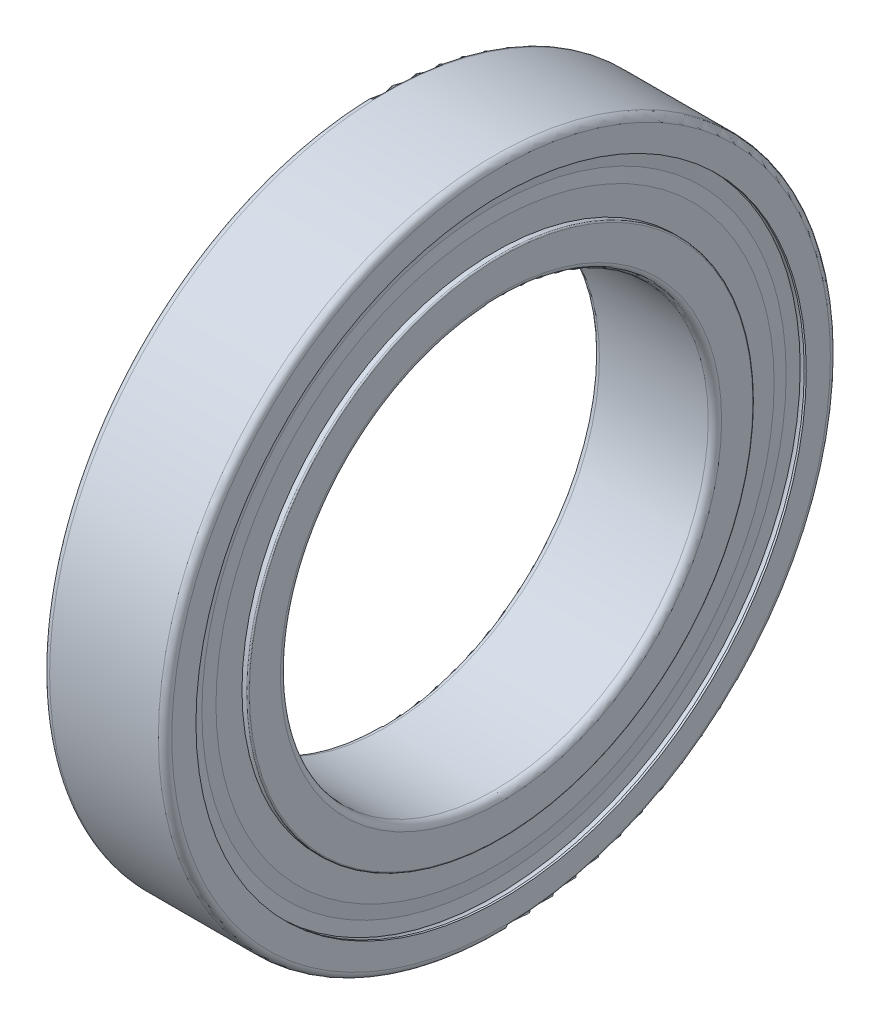
ISO-10303-21;
HEADER;
FILE_DESCRIPTION(('STEP AP214'),'2;1');
FILE_NAME('part.step','',(''),(''),'','','');
FILE_SCHEMA(('AUTOMOTIVE_DESIGN { 1 0 10303 214 1 1 1 1 }'));
ENDSEC;
DATA;
#1=APPLICATION_CONTEXT('core data for automotive mechanical design processes');
#2=APPLICATION_PROTOCOL_DEFINITION('international standard','automotive_design',2000,#1);
#3=PRODUCT_CONTEXT('',#1,'mechanical');
#4=PRODUCT('Part','Part','',(#3));
#5=PRODUCT_RELATED_PRODUCT_CATEGORY('part','',(#4));
#6=PRODUCT_DEFINITION_FORMATION('','',#4);
#7=PRODUCT_DEFINITION_CONTEXT('part definition',#1,'design');
#8=PRODUCT_DEFINITION('design','',#6,#7);
#9=PRODUCT_DEFINITION_SHAPE('','',#8);
#10=(LENGTH_UNIT() NAMED_UNIT(*) SI_UNIT(.MILLI.,.METRE.));
#11=(NAMED_UNIT(*) PLANE_ANGLE_UNIT() SI_UNIT($,.RADIAN.));
#12=(NAMED_UNIT(*) SI_UNIT($,.STERADIAN.) SOLID_ANGLE_UNIT());
#13=UNCERTAINTY_MEASURE_WITH_UNIT(LENGTH_MEASURE(1.E-05),#10,'distance_accuracy_value','');
#14=(GEOMETRIC_REPRESENTATION_CONTEXT(3) GLOBAL_UNCERTAINTY_ASSIGNED_CONTEXT((#13)) GLOBAL_UNIT_ASSIGNED_CONTEXT((#10,
#11,#12)) REPRESENTATION_CONTEXT('',''));
#15=CARTESIAN_POINT('',(0.,0.,0.));
#16=DIRECTION('',(0.,0.,1.));
#17=DIRECTION('',(1.,0.,0.));
#18=AXIS2_PLACEMENT_3D('',#15,#16,#17);
#19=CARTESIAN_POINT('',(18.68,0.,0.));
#20=DIRECTION('',(1.,0.,0.));
#21=DIRECTION('',(0.,0.,-1.));
#22=AXIS2_PLACEMENT_3D('',#19,#20,#21);
#23=CONICAL_SURFACE('',#22,49.95,1.4173547102);
#24=CARTESIAN_POINT('',(18.68,0.,0.));
#25=DIRECTION('',(1.,0.,0.));
#26=DIRECTION('',(0.,0.,-1.));
#27=AXIS2_PLACEMENT_3D('',#24,#25,#26);
#28=CIRCLE('',#27,49.95);
#29=CARTESIAN_POINT('',(18.68,0.,-49.95));
#30=VERTEX_POINT('',#29);
#31=EDGE_CURVE('P0_E20',#30,#30,#28,.T.);
#32=ORIENTED_EDGE('',*,*,#31,.F.);
#33=EDGE_LOOP('',(#32));
#34=FACE_BOUND('',#33,.T.);
#35=CARTESIAN_POINT('',(18.35,0.,0.));
#36=DIRECTION('',(1.,0.,0.));
#37=DIRECTION('',(0.,0.,-1.));
#38=AXIS2_PLACEMENT_3D('',#35,#36,#37);
#39=CIRCLE('',#38,47.81625);
#40=CARTESIAN_POINT('',(18.35,0.,-47.81625));
#41=VERTEX_POINT('',#40);
#42=EDGE_CURVE('P0_E11',#41,#41,#39,.T.);
#43=ORIENTED_EDGE('',*,*,#42,.T.);
#44=EDGE_LOOP('',(#43));
#45=FACE_BOUND('',#44,.T.);
#46=ADVANCED_FACE('P0_F16',(#34,#45),#23,.T.);
#47=CARTESIAN_POINT('',(18.35,47.81625,0.));
#48=DIRECTION('',(-1.,0.,0.));
#49=DIRECTION('',(0.,0.,1.));
#50=AXIS2_PLACEMENT_3D('',#47,#48,#49);
#51=PLANE('',#50);
#52=ORIENTED_EDGE('',*,*,#42,.F.);
#53=EDGE_LOOP('',(#52));
#54=FACE_BOUND('',#53,.T.);
#55=CARTESIAN_POINT('',(18.35,0.,0.));
#56=DIRECTION('',(1.,0.,0.));
#57=DIRECTION('',(0.,0.,-1.));
#58=AXIS2_PLACEMENT_3D('',#55,#56,#57);
#59=CIRCLE('',#58,45.6825);
#60=CARTESIAN_POINT('',(18.35,0.,-45.6825));
#61=VERTEX_POINT('',#60);
#62=EDGE_CURVE('P0_E27',#61,#61,#59,.T.);
#63=ORIENTED_EDGE('',*,*,#62,.T.);
#64=EDGE_LOOP('',(#63));
#65=FACE_BOUND('',#64,.T.);
#66=ADVANCED_FACE('P0_F263',(#54,#65),#51,.T.);
#67=CARTESIAN_POINT('',(1.65,0.,0.));
#68=DIRECTION('',(-1.,0.,0.));
#69=DIRECTION('',(0.,0.,1.));
#70=AXIS2_PLACEMENT_3D('',#67,#68,#69);
#71=CONICAL_SURFACE('',#70,47.81625,1.4173547102);
#72=CARTESIAN_POINT('',(1.32,0.,0.));
#73=DIRECTION('',(1.,0.,0.));
#74=DIRECTION('',(0.,0.,-1.));
#75=AXIS2_PLACEMENT_3D('',#72,#73,#74);
#76=CIRCLE('',#75,49.95);
#77=CARTESIAN_POINT('',(1.32,0.,-49.95));
#78=VERTEX_POINT('',#77);
#79=EDGE_CURVE('P0_E176',#78,#78,#76,.T.);
#80=ORIENTED_EDGE('',*,*,#79,.T.);
#81=EDGE_LOOP('',(#80));
#82=FACE_BOUND('',#81,.T.);
#83=CARTESIAN_POINT('',(1.65,0.,0.));
#84=DIRECTION('',(1.,0.,0.));
#85=DIRECTION('',(0.,0.,-1.));
#86=AXIS2_PLACEMENT_3D('',#83,#84,#85);
#87=CIRCLE('',#86,47.81625);
#88=CARTESIAN_POINT('',(1.65,0.,-47.81625));
#89=VERTEX_POINT('',#88);
#90=EDGE_CURVE('P0_E171',#89,#89,#87,.T.);
#91=ORIENTED_EDGE('',*,*,#90,.F.);
#92=EDGE_LOOP('',(#91));
#93=FACE_BOUND('',#92,.T.);
#94=ADVANCED_FACE('P0_F268',(#82,#93),#71,.T.);
#95=CARTESIAN_POINT('',(50.,0.,0.));
#96=DIRECTION('',(-1.,0.,0.));
#97=DIRECTION('',(0.,0.,-1.));
#98=AXIS2_PLACEMENT_3D('',#95,#96,#97);
#99=CYLINDRICAL_SURFACE('',#98,41.425);
#100=CARTESIAN_POINT('',(18.6792267135325,0.,0.));
#101=DIRECTION('',(1.,0.,0.));
#102=DIRECTION('',(0.,0.,1.));
#103=AXIS2_PLACEMENT_3D('',#100,#101,#102);
#104=CIRCLE('',#103,41.425);
#105=CARTESIAN_POINT('',(18.6792267135325,0.,41.425));
#106=VERTEX_POINT('',#105);
#107=EDGE_CURVE('P0_E207',#106,#106,#104,.T.);
#108=ORIENTED_EDGE('',*,*,#107,.F.);
#109=EDGE_LOOP('',(#108));
#110=FACE_BOUND('',#109,.T.);
#111=CARTESIAN_POINT('',(14.7599983193274,0.,0.));
#112=DIRECTION('',(1.,0.,0.));
#113=DIRECTION('',(0.,0.,-1.));
#114=AXIS2_PLACEMENT_3D('',#111,#112,#113);
#115=CIRCLE('',#114,41.425);
#116=CARTESIAN_POINT('',(14.7599983193274,0.,-41.425));
#117=VERTEX_POINT('',#116);
#118=EDGE_CURVE('P0_E172',#117,#117,#115,.T.);
#119=ORIENTED_EDGE('',*,*,#118,.T.);
#120=EDGE_LOOP('',(#119));
#121=FACE_BOUND('',#120,.T.);
#122=ADVANCED_FACE('P0_F315',(#110,#121),#99,.T.);
#123=CARTESIAN_POINT('',(50.,0.,0.));
#124=DIRECTION('',(-1.,0.,0.));
#125=DIRECTION('',(0.,0.,-1.));
#126=AXIS2_PLACEMENT_3D('',#123,#124,#125);
#127=CYLINDRICAL_SURFACE('',#126,41.425);
#128=CARTESIAN_POINT('',(0.99,0.,0.));
#129=DIRECTION('',(1.,0.,0.));
#130=DIRECTION('',(0.,0.,1.));
#131=AXIS2_PLACEMENT_3D('',#128,#129,#130);
#132=CIRCLE('',#131,41.425);
#133=CARTESIAN_POINT('',(0.99,0.,41.425));
#134=VERTEX_POINT('',#133);
#135=EDGE_CURVE('P0_E159',#134,#134,#132,.T.);
#136=ORIENTED_EDGE('',*,*,#135,.F.);
#137=EDGE_LOOP('',(#136));
#138=FACE_BOUND('',#137,.T.);
#139=CARTESIAN_POINT('',(0.22,0.,0.));
#140=DIRECTION('',(1.,0.,0.));
#141=DIRECTION('',(0.,0.,-1.));
#142=AXIS2_PLACEMENT_3D('',#139,#140,#141);
#143=CIRCLE('',#142,41.425);
#144=CARTESIAN_POINT('',(0.22,0.,-41.425));
#145=VERTEX_POINT('',#144);
#146=EDGE_CURVE('P0_E177',#145,#145,#143,.T.);
#147=ORIENTED_EDGE('',*,*,#146,.T.);
#148=EDGE_LOOP('',(#147));
#149=FACE_BOUND('',#148,.T.);
#150=ADVANCED_FACE('P0_F309',(#138,#149),#127,.T.);
#151=CARTESIAN_POINT('',(50.,0.,0.));
#152=DIRECTION('',(-1.,0.,0.));
#153=DIRECTION('',(0.,0.,-1.));
#154=AXIS2_PLACEMENT_3D('',#151,#152,#153);
#155=CYLINDRICAL_SURFACE('',#154,41.425);
#156=CARTESIAN_POINT('',(19.78,0.,0.));
#157=DIRECTION('',(1.,0.,0.));
#158=DIRECTION('',(0.,0.,-1.));
#159=AXIS2_PLACEMENT_3D('',#156,#157,#158);
#160=CIRCLE('',#159,41.425);
#161=CARTESIAN_POINT('',(19.78,0.,-41.425));
#162=VERTEX_POINT('',#161);
#163=EDGE_CURVE('P0_E183',#162,#162,#160,.T.);
#164=ORIENTED_EDGE('',*,*,#163,.F.);
#165=EDGE_LOOP('',(#164));
#166=FACE_BOUND('',#165,.T.);
#167=CARTESIAN_POINT('',(19.01,0.,0.));
#168=DIRECTION('',(-1.,0.,0.));
#169=DIRECTION('',(0.,0.,-1.));
#170=AXIS2_PLACEMENT_3D('',#167,#168,#169);
#171=CIRCLE('',#170,41.425);
#172=CARTESIAN_POINT('',(19.01,0.,-41.425));
#173=VERTEX_POINT('',#172);
#174=EDGE_CURVE('P0_E146',#173,#173,#171,.T.);
#175=ORIENTED_EDGE('',*,*,#174,.F.);
#176=EDGE_LOOP('',(#175));
#177=FACE_BOUND('',#176,.T.);
#178=ADVANCED_FACE('P0_F307',(#166,#177),#155,.T.);
#179=CARTESIAN_POINT('',(10.,0.,0.));
#180=DIRECTION('',(1.,0.,0.));
#181=DIRECTION('',(0.,0.,-1.));
#182=AXIS2_PLACEMENT_3D('',#179,#180,#181);
#183=TOROIDAL_SURFACE('',#182,45.,5.953);
#184=CARTESIAN_POINT('',(5.24000168067257,0.,0.));
#185=DIRECTION('',(1.,0.,0.));
#186=DIRECTION('',(0.,0.,-1.));
#187=AXIS2_PLACEMENT_3D('',#184,#185,#186);
#188=CIRCLE('',#187,41.425);
#189=CARTESIAN_POINT('',(5.24000168067257,0.,-41.425));
#190=VERTEX_POINT('',#189);
#191=EDGE_CURVE('P0_E187',#190,#190,#188,.T.);
#192=ORIENTED_EDGE('',*,*,#191,.T.);
#193=EDGE_LOOP('',(#192));
#194=FACE_BOUND('',#193,.T.);
#195=ORIENTED_EDGE('',*,*,#118,.F.);
#196=EDGE_LOOP('',(#195));
#197=FACE_BOUND('',#196,.T.);
#198=ADVANCED_FACE('P0_F257',(#194,#197),#183,.F.);
#199=CARTESIAN_POINT('',(19.78,0.,0.));
#200=DIRECTION('',(1.,0.,0.));
#201=DIRECTION('',(0.,0.,-1.));
#202=AXIS2_PLACEMENT_3D('',#199,#200,#201);
#203=TOROIDAL_SURFACE('',#202,41.205,0.22);
#204=CARTESIAN_POINT('',(20.,0.,0.));
#205=DIRECTION('',(1.,0.,0.));
#206=DIRECTION('',(0.,0.,-1.));
#207=AXIS2_PLACEMENT_3D('',#204,#205,#206);
#208=CIRCLE('',#207,41.205);
#209=CARTESIAN_POINT('',(20.,0.,-41.205));
#210=VERTEX_POINT('',#209);
#211=EDGE_CURVE('P0_E188',#210,#210,#208,.T.);
#212=ORIENTED_EDGE('',*,*,#211,.F.);
#213=EDGE_LOOP('',(#212));
#214=FACE_BOUND('',#213,.T.);
#215=ORIENTED_EDGE('',*,*,#163,.T.);
#216=EDGE_LOOP('',(#215));
#217=FACE_BOUND('',#216,.T.);
#218=ADVANCED_FACE('P0_F246',(#214,#217),#203,.T.);
#219=CARTESIAN_POINT('',(20.,36.1,0.));
#220=DIRECTION('',(1.,0.,0.));
#221=DIRECTION('',(0.,1.,0.));
#222=AXIS2_PLACEMENT_3D('',#219,#220,#221);
#223=PLANE('',#222);
#224=ORIENTED_EDGE('',*,*,#211,.T.);
#225=EDGE_LOOP('',(#224));
#226=FACE_BOUND('',#225,.T.);
#227=CARTESIAN_POINT('',(20.,0.,0.));
#228=DIRECTION('',(1.,0.,0.));
#229=DIRECTION('',(0.,0.,-1.));
#230=AXIS2_PLACEMENT_3D('',#227,#228,#229);
#231=CIRCLE('',#230,36.1);
#232=CARTESIAN_POINT('',(20.,0.,-36.1));
#233=VERTEX_POINT('',#232);
#234=EDGE_CURVE('P0_E164',#233,#233,#231,.T.);
#235=ORIENTED_EDGE('',*,*,#234,.F.);
#236=EDGE_LOOP('',(#235));
#237=FACE_BOUND('',#236,.T.);
#238=ADVANCED_FACE('P0_F244',(#226,#237),#223,.T.);
#239=CARTESIAN_POINT('',(18.9,0.,0.));
#240=DIRECTION('',(1.,0.,0.));
#241=DIRECTION('',(0.,0.,-1.));
#242=AXIS2_PLACEMENT_3D('',#239,#240,#241);
#243=TOROIDAL_SURFACE('',#242,36.1,1.1);
#244=CARTESIAN_POINT('',(18.9,0.,0.));
#245=DIRECTION('',(1.,0.,0.));
#246=DIRECTION('',(0.,0.,-1.));
#247=AXIS2_PLACEMENT_3D('',#244,#245,#246);
#248=CIRCLE('',#247,35.);
#249=CARTESIAN_POINT('',(18.9,0.,-35.));
#250=VERTEX_POINT('',#249);
#251=EDGE_CURVE('P0_E161',#250,#250,#248,.T.);
#252=ORIENTED_EDGE('',*,*,#251,.F.);
#253=EDGE_LOOP('',(#252));
#254=FACE_BOUND('',#253,.T.);
#255=ORIENTED_EDGE('',*,*,#234,.T.);
#256=EDGE_LOOP('',(#255));
#257=FACE_BOUND('',#256,.T.);
#258=ADVANCED_FACE('P0_F242',(#254,#257),#243,.T.);
#259=CARTESIAN_POINT('',(50.,0.,0.));
#260=DIRECTION('',(-1.,0.,0.));
#261=DIRECTION('',(0.,0.,-1.));
#262=AXIS2_PLACEMENT_3D('',#259,#260,#261);
#263=CYLINDRICAL_SURFACE('',#262,35.);
#264=CARTESIAN_POINT('',(1.1,0.,0.));
#265=DIRECTION('',(1.,0.,0.));
#266=DIRECTION('',(0.,0.,-1.));
#267=AXIS2_PLACEMENT_3D('',#264,#265,#266);
#268=CIRCLE('',#267,35.);
#269=CARTESIAN_POINT('',(1.1,0.,-35.));
#270=VERTEX_POINT('',#269);
#271=EDGE_CURVE('P0_E165',#270,#270,#268,.T.);
#272=ORIENTED_EDGE('',*,*,#271,.F.);
#273=EDGE_LOOP('',(#272));
#274=FACE_BOUND('',#273,.T.);
#275=ORIENTED_EDGE('',*,*,#251,.T.);
#276=EDGE_LOOP('',(#275));
#277=FACE_BOUND('',#276,.T.);
#278=ADVANCED_FACE('P0_F254',(#274,#277),#263,.F.);
#279=CARTESIAN_POINT('',(1.09999999999998,0.,0.));
#280=DIRECTION('',(1.,0.,0.));
#281=DIRECTION('',(0.,0.,-1.));
#282=AXIS2_PLACEMENT_3D('',#279,#280,#281);
#283=TOROIDAL_SURFACE('',#282,36.1,1.1);
#284=CARTESIAN_POINT('',(0.,0.,0.));
#285=DIRECTION('',(1.,0.,0.));
#286=DIRECTION('',(0.,0.,-1.));
#287=AXIS2_PLACEMENT_3D('',#284,#285,#286);
#288=CIRCLE('',#287,36.1);
#289=CARTESIAN_POINT('',(0.,0.,-36.1));
#290=VERTEX_POINT('',#289);
#291=EDGE_CURVE('P0_E182',#290,#290,#288,.T.);
#292=ORIENTED_EDGE('',*,*,#291,.F.);
#293=EDGE_LOOP('',(#292));
#294=FACE_BOUND('',#293,.T.);
#295=ORIENTED_EDGE('',*,*,#271,.T.);
#296=EDGE_LOOP('',(#295));
#297=FACE_BOUND('',#296,.T.);
#298=ADVANCED_FACE('P0_F274',(#294,#297),#283,.T.);
#299=CARTESIAN_POINT('',(0.,41.205,0.));
#300=DIRECTION('',(-1.,0.,0.));
#301=DIRECTION('',(0.,0.,1.));
#302=AXIS2_PLACEMENT_3D('',#299,#300,#301);
#303=PLANE('',#302);
#304=CARTESIAN_POINT('',(0.,0.,0.));
#305=DIRECTION('',(1.,0.,0.));
#306=DIRECTION('',(0.,0.,-1.));
#307=AXIS2_PLACEMENT_3D('',#304,#305,#306);
#308=CIRCLE('',#307,41.205);
#309=CARTESIAN_POINT('',(0.,0.,-41.205));
#310=VERTEX_POINT('',#309);
#311=EDGE_CURVE('P0_E178',#310,#310,#308,.T.);
#312=ORIENTED_EDGE('',*,*,#311,.F.);
#313=EDGE_LOOP('',(#312));
#314=FACE_BOUND('',#313,.T.);
#315=ORIENTED_EDGE('',*,*,#291,.T.);
#316=EDGE_LOOP('',(#315));
#317=FACE_BOUND('',#316,.T.);
#318=ADVANCED_FACE('P0_F277',(#314,#317),#303,.T.);
#319=CARTESIAN_POINT('',(0.220000000000006,0.,0.));
#320=DIRECTION('',(1.,0.,0.));
#321=DIRECTION('',(0.,0.,-1.));
#322=AXIS2_PLACEMENT_3D('',#319,#320,#321);
#323=TOROIDAL_SURFACE('',#322,41.205,0.22);
#324=ORIENTED_EDGE('',*,*,#146,.F.);
#325=EDGE_LOOP('',(#324));
#326=FACE_BOUND('',#325,.T.);
#327=ORIENTED_EDGE('',*,*,#311,.T.);
#328=EDGE_LOOP('',(#327));
#329=FACE_BOUND('',#328,.T.);
#330=ADVANCED_FACE('P0_F294',(#326,#329),#323,.T.);
#331=CARTESIAN_POINT('',(0.99,45.6825,0.));
#332=DIRECTION('',(-1.,0.,0.));
#333=DIRECTION('',(0.,0.,1.));
#334=AXIS2_PLACEMENT_3D('',#331,#332,#333);
#335=PLANE('',#334);
#336=CARTESIAN_POINT('',(0.99,0.,0.));
#337=DIRECTION('',(1.,0.,0.));
#338=DIRECTION('',(0.,0.,-1.));
#339=AXIS2_PLACEMENT_3D('',#336,#337,#338);
#340=CIRCLE('',#339,45.6825);
#341=CARTESIAN_POINT('',(0.99,0.,-45.6825));
#342=VERTEX_POINT('',#341);
#343=EDGE_CURVE('P0_E196',#342,#342,#340,.T.);
#344=ORIENTED_EDGE('',*,*,#343,.F.);
#345=EDGE_LOOP('',(#344));
#346=FACE_BOUND('',#345,.T.);
#347=ORIENTED_EDGE('',*,*,#135,.T.);
#348=EDGE_LOOP('',(#347));
#349=FACE_BOUND('',#348,.T.);
#350=ADVANCED_FACE('P0_F288',(#346,#349),#335,.T.);
#351=CARTESIAN_POINT('',(1.155,0.,0.));
#352=DIRECTION('',(1.,0.,0.));
#353=DIRECTION('',(0.,0.,-1.));
#354=AXIS2_PLACEMENT_3D('',#351,#352,#353);
#355=CONICAL_SURFACE('',#354,47.81625,1.4936212639);
#356=CARTESIAN_POINT('',(1.155,0.,0.));
#357=DIRECTION('',(1.,0.,0.));
#358=DIRECTION('',(0.,0.,-1.));
#359=AXIS2_PLACEMENT_3D('',#356,#357,#358);
#360=CIRCLE('',#359,47.81625);
#361=CARTESIAN_POINT('',(1.155,0.,-47.81625));
#362=VERTEX_POINT('',#361);
#363=EDGE_CURVE('P0_E170',#362,#362,#360,.T.);
#364=ORIENTED_EDGE('',*,*,#363,.F.);
#365=EDGE_LOOP('',(#364));
#366=FACE_BOUND('',#365,.T.);
#367=ORIENTED_EDGE('',*,*,#343,.T.);
#368=EDGE_LOOP('',(#367));
#369=FACE_BOUND('',#368,.T.);
#370=ADVANCED_FACE('P0_F285',(#366,#369),#355,.T.);
#371=CARTESIAN_POINT('',(0.99,0.,0.));
#372=DIRECTION('',(-1.,0.,0.));
#373=DIRECTION('',(0.,0.,1.));
#374=AXIS2_PLACEMENT_3D('',#371,#372,#373);
#375=CONICAL_SURFACE('',#374,49.95,1.4936212639);
#376=CARTESIAN_POINT('',(0.99,0.,0.));
#377=DIRECTION('',(1.,0.,0.));
#378=DIRECTION('',(0.,0.,-1.));
#379=AXIS2_PLACEMENT_3D('',#376,#377,#378);
#380=CIRCLE('',#379,49.95);
#381=CARTESIAN_POINT('',(0.99,0.,-49.95));
#382=VERTEX_POINT('',#381);
#383=EDGE_CURVE('P0_E166',#382,#382,#380,.T.);
#384=ORIENTED_EDGE('',*,*,#383,.F.);
#385=EDGE_LOOP('',(#384));
#386=FACE_BOUND('',#385,.T.);
#387=ORIENTED_EDGE('',*,*,#363,.T.);
#388=EDGE_LOOP('',(#387));
#389=FACE_BOUND('',#388,.T.);
#390=ADVANCED_FACE('P0_F283',(#386,#389),#375,.F.);
#391=CARTESIAN_POINT('',(50.,0.,0.));
#392=DIRECTION('',(-1.,0.,0.));
#393=DIRECTION('',(0.,0.,-1.));
#394=AXIS2_PLACEMENT_3D('',#391,#392,#393);
#395=CYLINDRICAL_SURFACE('',#394,49.95);
#396=ORIENTED_EDGE('',*,*,#79,.F.);
#397=EDGE_LOOP('',(#396));
#398=FACE_BOUND('',#397,.T.);
#399=ORIENTED_EDGE('',*,*,#383,.T.);
#400=EDGE_LOOP('',(#399));
#401=FACE_BOUND('',#400,.T.);
#402=ADVANCED_FACE('P0_F279',(#398,#401),#395,.T.);
#403=CARTESIAN_POINT('',(1.65,45.6825,0.));
#404=DIRECTION('',(1.,0.,0.));
#405=DIRECTION('',(0.,1.,0.));
#406=AXIS2_PLACEMENT_3D('',#403,#404,#405);
#407=PLANE('',#406);
#408=ORIENTED_EDGE('',*,*,#90,.T.);
#409=EDGE_LOOP('',(#408));
#410=FACE_BOUND('',#409,.T.);
#411=CARTESIAN_POINT('',(1.65,0.,0.));
#412=DIRECTION('',(1.,0.,0.));
#413=DIRECTION('',(0.,0.,-1.));
#414=AXIS2_PLACEMENT_3D('',#411,#412,#413);
#415=CIRCLE('',#414,45.6825);
#416=CARTESIAN_POINT('',(1.65,0.,-45.6825));
#417=VERTEX_POINT('',#416);
#418=EDGE_CURVE('P0_E192',#417,#417,#415,.T.);
#419=ORIENTED_EDGE('',*,*,#418,.F.);
#420=EDGE_LOOP('',(#419));
#421=FACE_BOUND('',#420,.T.);
#422=ADVANCED_FACE('P0_F282',(#410,#421),#407,.T.);
#423=CARTESIAN_POINT('',(1.32,0.,0.));
#424=DIRECTION('',(1.,0.,0.));
#425=DIRECTION('',(0.,0.,-1.));
#426=AXIS2_PLACEMENT_3D('',#423,#424,#425);
#427=CONICAL_SURFACE('',#426,41.415,1.4936212639);
#428=ORIENTED_EDGE('',*,*,#418,.T.);
#429=EDGE_LOOP('',(#428));
#430=FACE_BOUND('',#429,.T.);
#431=CARTESIAN_POINT('',(1.32077328646749,0.,0.));
#432=DIRECTION('',(-1.,0.,0.));
#433=DIRECTION('',(0.,0.,-1.));
#434=AXIS2_PLACEMENT_3D('',#431,#432,#433);
#435=CIRCLE('',#434,41.425);
#436=CARTESIAN_POINT('',(1.32077328646749,0.,-41.425));
#437=VERTEX_POINT('',#436);
#438=EDGE_CURVE('P0_E213',#437,#437,#435,.T.);
#439=ORIENTED_EDGE('',*,*,#438,.T.);
#440=EDGE_LOOP('',(#439));
#441=FACE_BOUND('',#440,.T.);
#442=ADVANCED_FACE('P0_F331',(#430,#441),#427,.F.);
#443=CARTESIAN_POINT('',(50.,0.,0.));
#444=DIRECTION('',(-1.,0.,0.));
#445=DIRECTION('',(0.,0.,-1.));
#446=AXIS2_PLACEMENT_3D('',#443,#444,#445);
#447=CYLINDRICAL_SURFACE('',#446,41.425);
#448=ORIENTED_EDGE('',*,*,#191,.F.);
#449=EDGE_LOOP('',(#448));
#450=FACE_BOUND('',#449,.T.);
#451=ORIENTED_EDGE('',*,*,#438,.F.);
#452=EDGE_LOOP('',(#451));
#453=FACE_BOUND('',#452,.T.);
#454=ADVANCED_FACE('P0_F272',(#450,#453),#447,.T.);
#455=CARTESIAN_POINT('',(18.35,0.,0.));
#456=DIRECTION('',(-1.,0.,0.));
#457=DIRECTION('',(0.,0.,1.));
#458=AXIS2_PLACEMENT_3D('',#455,#456,#457);
#459=CONICAL_SURFACE('',#458,45.6825,1.4936212639);
#460=ORIENTED_EDGE('',*,*,#62,.F.);
#461=EDGE_LOOP('',(#460));
#462=FACE_BOUND('',#461,.T.);
#463=ORIENTED_EDGE('',*,*,#107,.T.);
#464=EDGE_LOOP('',(#463));
#465=FACE_BOUND('',#464,.T.);
#466=ADVANCED_FACE('P0_F303',(#462,#465),#459,.F.);
#467=CARTESIAN_POINT('',(19.01,41.415,0.));
#468=DIRECTION('',(1.,0.,0.));
#469=DIRECTION('',(0.,1.,0.));
#470=AXIS2_PLACEMENT_3D('',#467,#468,#469);
#471=PLANE('',#470);
#472=CARTESIAN_POINT('',(19.01,0.,0.));
#473=DIRECTION('',(1.,0.,0.));
#474=DIRECTION('',(0.,0.,-1.));
#475=AXIS2_PLACEMENT_3D('',#472,#473,#474);
#476=CIRCLE('',#475,45.6825);
#477=CARTESIAN_POINT('',(19.01,0.,-45.6825));
#478=VERTEX_POINT('',#477);
#479=EDGE_CURVE('P0_E153',#478,#478,#476,.T.);
#480=ORIENTED_EDGE('',*,*,#479,.T.);
#481=EDGE_LOOP('',(#480));
#482=FACE_BOUND('',#481,.T.);
#483=ORIENTED_EDGE('',*,*,#174,.T.);
#484=EDGE_LOOP('',(#483));
#485=FACE_BOUND('',#484,.T.);
#486=ADVANCED_FACE('P0_F18',(#482,#485),#471,.T.);
#487=CARTESIAN_POINT('',(19.01,0.,0.));
#488=DIRECTION('',(-1.,0.,0.));
#489=DIRECTION('',(0.,0.,1.));
#490=AXIS2_PLACEMENT_3D('',#487,#488,#489);
#491=CONICAL_SURFACE('',#490,45.6825,1.4936212639);
#492=CARTESIAN_POINT('',(18.845,0.,0.));
#493=DIRECTION('',(1.,0.,0.));
#494=DIRECTION('',(0.,0.,-1.));
#495=AXIS2_PLACEMENT_3D('',#492,#493,#494);
#496=CIRCLE('',#495,47.81625);
#497=CARTESIAN_POINT('',(18.845,0.,-47.81625));
#498=VERTEX_POINT('',#497);
#499=EDGE_CURVE('P0_E142',#498,#498,#496,.T.);
#500=ORIENTED_EDGE('',*,*,#499,.T.);
#501=EDGE_LOOP('',(#500));
#502=FACE_BOUND('',#501,.T.);
#503=ORIENTED_EDGE('',*,*,#479,.F.);
#504=EDGE_LOOP('',(#503));
#505=FACE_BOUND('',#504,.T.);
#506=ADVANCED_FACE('P0_F290',(#502,#505),#491,.T.);
#507=CARTESIAN_POINT('',(18.845,0.,0.));
#508=DIRECTION('',(1.,0.,0.));
#509=DIRECTION('',(0.,0.,-1.));
#510=AXIS2_PLACEMENT_3D('',#507,#508,#509);
#511=CONICAL_SURFACE('',#510,47.81625,1.4936212639);
#512=CARTESIAN_POINT('',(19.01,0.,0.));
#513=DIRECTION('',(1.,0.,0.));
#514=DIRECTION('',(0.,0.,-1.));
#515=AXIS2_PLACEMENT_3D('',#512,#513,#514);
#516=CIRCLE('',#515,49.95);
#517=CARTESIAN_POINT('',(19.01,0.,-49.95));
#518=VERTEX_POINT('',#517);
#519=EDGE_CURVE('P0_E136',#518,#518,#516,.T.);
#520=ORIENTED_EDGE('',*,*,#519,.T.);
#521=EDGE_LOOP('',(#520));
#522=FACE_BOUND('',#521,.T.);
#523=ORIENTED_EDGE('',*,*,#499,.F.);
#524=EDGE_LOOP('',(#523));
#525=FACE_BOUND('',#524,.T.);
#526=ADVANCED_FACE('P0_F143',(#522,#525),#511,.F.);
#527=CARTESIAN_POINT('',(50.,0.,0.));
#528=DIRECTION('',(-1.,0.,0.));
#529=DIRECTION('',(0.,0.,-1.));
#530=AXIS2_PLACEMENT_3D('',#527,#528,#529);
#531=CYLINDRICAL_SURFACE('',#530,49.95);
#532=ORIENTED_EDGE('',*,*,#519,.F.);
#533=EDGE_LOOP('',(#532));
#534=FACE_BOUND('',#533,.T.);
#535=ORIENTED_EDGE('',*,*,#31,.T.);
#536=EDGE_LOOP('',(#535));
#537=FACE_BOUND('',#536,.T.);
#538=ADVANCED_FACE('P0_F327',(#534,#537),#531,.T.);
#539=CLOSED_SHELL('',(#46,#66,#94,#122,#150,#178,#198,#218,#238,#258,#278,#298,#318,#330,#350,
#370,#390,#402,#422,#442,#454,#466,#486,#506,#526,#538));
#540=MANIFOLD_SOLID_BREP('P0_B1',#539);
#541=CARTESIAN_POINT('',(1.1,0.,0.));
#542=DIRECTION('',(1.,0.,0.));
#543=DIRECTION('',(0.,0.,-1.));
#544=AXIS2_PLACEMENT_3D('',#541,#542,#543);
#545=TOROIDAL_SURFACE('',#544,53.9,1.1);
#546=CARTESIAN_POINT('',(1.1,0.,0.));
#547=DIRECTION('',(1.,0.,0.));
#548=DIRECTION('',(0.,0.,-1.));
#549=AXIS2_PLACEMENT_3D('',#546,#547,#548);
#550=CIRCLE('',#549,55.);
#551=CARTESIAN_POINT('',(1.1,0.,-55.));
#552=VERTEX_POINT('',#551);
#553=EDGE_CURVE('P1_E39',#552,#552,#550,.T.);
#554=ORIENTED_EDGE('',*,*,#553,.F.);
#555=EDGE_LOOP('',(#554));
#556=FACE_BOUND('',#555,.T.);
#557=CARTESIAN_POINT('',(0.,0.,0.));
#558=DIRECTION('',(1.,0.,0.));
#559=DIRECTION('',(0.,0.,-1.));
#560=AXIS2_PLACEMENT_3D('',#557,#558,#559);
#561=CIRCLE('',#560,53.9);
#562=CARTESIAN_POINT('',(0.,0.,-53.9));
#563=VERTEX_POINT('',#562);
#564=EDGE_CURVE('P1_E11',#563,#563,#561,.T.);
#565=ORIENTED_EDGE('',*,*,#564,.T.);
#566=EDGE_LOOP('',(#565));
#567=FACE_BOUND('',#566,.T.);
#568=ADVANCED_FACE('P1_F16',(#556,#567),#545,.T.);
#569=CARTESIAN_POINT('',(0.,53.9,0.));
#570=DIRECTION('',(-1.,0.,0.));
#571=DIRECTION('',(0.,0.,1.));
#572=AXIS2_PLACEMENT_3D('',#569,#570,#571);
#573=PLANE('',#572);
#574=ORIENTED_EDGE('',*,*,#564,.F.);
#575=EDGE_LOOP('',(#574));
#576=FACE_BOUND('',#575,.T.);
#577=CARTESIAN_POINT('',(0.,0.,0.));
#578=DIRECTION('',(1.,0.,0.));
#579=DIRECTION('',(0.,0.,-1.));
#580=AXIS2_PLACEMENT_3D('',#577,#578,#579);
#581=CIRCLE('',#580,49.95);
#582=CARTESIAN_POINT('',(0.,0.,-49.95));
#583=VERTEX_POINT('',#582);
#584=EDGE_CURVE('P1_E27',#583,#583,#581,.T.);
#585=ORIENTED_EDGE('',*,*,#584,.T.);
#586=EDGE_LOOP('',(#585));
#587=FACE_BOUND('',#586,.T.);
#588=ADVANCED_FACE('P1_F174',(#576,#587),#573,.T.);
#589=CARTESIAN_POINT('',(50.,0.,0.));
#590=DIRECTION('',(-1.,0.,0.));
#591=DIRECTION('',(0.,0.,-1.));
#592=AXIS2_PLACEMENT_3D('',#589,#590,#591);
#593=CYLINDRICAL_SURFACE('',#592,49.95);
#594=ORIENTED_EDGE('',*,*,#584,.F.);
#595=EDGE_LOOP('',(#594));
#596=FACE_BOUND('',#595,.T.);
#597=CARTESIAN_POINT('',(0.33,0.,0.));
#598=DIRECTION('',(1.,0.,0.));
#599=DIRECTION('',(0.,0.,-1.));
#600=AXIS2_PLACEMENT_3D('',#597,#598,#599);
#601=CIRCLE('',#600,49.95);
#602=CARTESIAN_POINT('',(0.33,0.,-49.95));
#603=VERTEX_POINT('',#602);
#604=EDGE_CURVE('P1_E134',#603,#603,#601,.T.);
#605=ORIENTED_EDGE('',*,*,#604,.T.);
#606=EDGE_LOOP('',(#605));
#607=FACE_BOUND('',#606,.T.);
#608=ADVANCED_FACE('P1_F179',(#596,#607),#593,.F.);
#609=CARTESIAN_POINT('',(0.99,0.,0.));
#610=DIRECTION('',(1.,0.,0.));
#611=DIRECTION('',(0.,0.,-1.));
#612=AXIS2_PLACEMENT_3D('',#609,#610,#611);
#613=TOROIDAL_SURFACE('',#612,49.9499999833,0.66);
#614=CARTESIAN_POINT('',(1.65,0.,0.));
#615=DIRECTION('',(1.,0.,0.));
#616=DIRECTION('',(0.,0.,-1.));
#617=AXIS2_PLACEMENT_3D('',#614,#615,#616);
#618=CIRCLE('',#617,49.95);
#619=CARTESIAN_POINT('',(1.65,0.,-49.95));
#620=VERTEX_POINT('',#619);
#621=EDGE_CURVE('P1_E138',#620,#620,#618,.T.);
#622=ORIENTED_EDGE('',*,*,#621,.T.);
#623=EDGE_LOOP('',(#622));
#624=FACE_BOUND('',#623,.T.);
#625=ORIENTED_EDGE('',*,*,#604,.F.);
#626=EDGE_LOOP('',(#625));
#627=FACE_BOUND('',#626,.T.);
#628=CARTESIAN_POINT('',(0.99,0.,-50.60999998334));
#629=VERTEX_POINT('',#628);
#630=VERTEX_LOOP('',#629);
#631=FACE_BOUND('',#630,.T.);
#632=ADVANCED_FACE('P1_F186',(#624,#627,#631),#613,.F.);
#633=CARTESIAN_POINT('',(1.65,0.,0.));
#634=DIRECTION('',(-1.,0.,0.));
#635=DIRECTION('',(0.,0.,1.));
#636=AXIS2_PLACEMENT_3D('',#633,#634,#635);
#637=CONICAL_SURFACE('',#636,49.95,1.3962634016);
#638=ORIENTED_EDGE('',*,*,#621,.F.);
#639=EDGE_LOOP('',(#638));
#640=FACE_BOUND('',#639,.T.);
#641=CARTESIAN_POINT('',(1.81945022846084,0.,0.));
#642=DIRECTION('',(1.,0.,0.));
#643=DIRECTION('',(0.,0.,-1.));
#644=AXIS2_PLACEMENT_3D('',#641,#642,#643);
#645=CIRCLE('',#644,48.989);
#646=CARTESIAN_POINT('',(1.81945022846084,0.,-48.989));
#647=VERTEX_POINT('',#646);
#648=EDGE_CURVE('P1_E131',#647,#647,#645,.T.);
#649=ORIENTED_EDGE('',*,*,#648,.T.);
#650=EDGE_LOOP('',(#649));
#651=FACE_BOUND('',#650,.T.);
#652=ADVANCED_FACE('P1_F189',(#640,#651),#637,.F.);
#653=CARTESIAN_POINT('',(50.,0.,0.));
#654=DIRECTION('',(-1.,0.,0.));
#655=DIRECTION('',(0.,0.,-1.));
#656=AXIS2_PLACEMENT_3D('',#653,#654,#655);
#657=CYLINDRICAL_SURFACE('',#656,48.989);
#658=ORIENTED_EDGE('',*,*,#648,.F.);
#659=EDGE_LOOP('',(#658));
#660=FACE_BOUND('',#659,.T.);
#661=CARTESIAN_POINT('',(5.58116666980978,0.,0.));
#662=DIRECTION('',(1.,0.,0.));
#663=DIRECTION('',(0.,0.,-1.));
#664=AXIS2_PLACEMENT_3D('',#661,#662,#663);
#665=CIRCLE('',#664,48.989);
#666=CARTESIAN_POINT('',(5.58116666980978,0.,-48.989));
#667=VERTEX_POINT('',#666);
#668=EDGE_CURVE('P1_E139',#667,#667,#665,.T.);
#669=ORIENTED_EDGE('',*,*,#668,.T.);
#670=EDGE_LOOP('',(#669));
#671=FACE_BOUND('',#670,.T.);
#672=ADVANCED_FACE('P1_F191',(#660,#671),#657,.F.);
#673=CARTESIAN_POINT('',(10.,0.,0.));
#674=DIRECTION('',(1.,0.,0.));
#675=DIRECTION('',(0.,0.,-1.));
#676=AXIS2_PLACEMENT_3D('',#673,#674,#675);
#677=TOROIDAL_SURFACE('',#676,45.,5.953);
#678=CARTESIAN_POINT('',(14.4188333301902,0.,0.));
#679=DIRECTION('',(1.,0.,0.));
#680=DIRECTION('',(0.,0.,-1.));
#681=AXIS2_PLACEMENT_3D('',#678,#679,#680);
#682=CIRCLE('',#681,48.989);
#683=CARTESIAN_POINT('',(14.4188333301902,0.,-48.989));
#684=VERTEX_POINT('',#683);
#685=EDGE_CURVE('P1_E71',#684,#684,#682,.T.);
#686=ORIENTED_EDGE('',*,*,#685,.T.);
#687=EDGE_LOOP('',(#686));
#688=FACE_BOUND('',#687,.T.);
#689=ORIENTED_EDGE('',*,*,#668,.F.);
#690=EDGE_LOOP('',(#689));
#691=FACE_BOUND('',#690,.T.);
#692=CARTESIAN_POINT('',(10.,0.,-50.953));
#693=VERTEX_POINT('',#692);
#694=VERTEX_LOOP('',#693);
#695=FACE_BOUND('',#694,.T.);
#696=ADVANCED_FACE('P1_F193',(#688,#691,#695),#677,.F.);
#697=CARTESIAN_POINT('',(50.,0.,0.));
#698=DIRECTION('',(-1.,0.,0.));
#699=DIRECTION('',(0.,0.,-1.));
#700=AXIS2_PLACEMENT_3D('',#697,#698,#699);
#701=CYLINDRICAL_SURFACE('',#700,48.989);
#702=ORIENTED_EDGE('',*,*,#685,.F.);
#703=EDGE_LOOP('',(#702));
#704=FACE_BOUND('',#703,.T.);
#705=CARTESIAN_POINT('',(18.1805497715392,0.,0.));
#706=DIRECTION('',(1.,0.,0.));
#707=DIRECTION('',(0.,0.,-1.));
#708=AXIS2_PLACEMENT_3D('',#705,#706,#707);
#709=CIRCLE('',#708,48.989);
#710=CARTESIAN_POINT('',(18.1805497715392,0.,-48.989));
#711=VERTEX_POINT('',#710);
#712=EDGE_CURVE('P1_E142',#711,#711,#709,.T.);
#713=ORIENTED_EDGE('',*,*,#712,.T.);
#714=EDGE_LOOP('',(#713));
#715=FACE_BOUND('',#714,.T.);
#716=ADVANCED_FACE('P1_F18',(#704,#715),#701,.F.);
#717=CARTESIAN_POINT('',(18.1805497715392,0.,0.));
#718=DIRECTION('',(1.,0.,0.));
#719=DIRECTION('',(0.,0.,-1.));
#720=AXIS2_PLACEMENT_3D('',#717,#718,#719);
#721=CONICAL_SURFACE('',#720,48.989,1.3962634016);
#722=CARTESIAN_POINT('',(18.35,0.,0.));
#723=DIRECTION('',(1.,0.,0.));
#724=DIRECTION('',(0.,0.,-1.));
#725=AXIS2_PLACEMENT_3D('',#722,#723,#724);
#726=CIRCLE('',#725,49.95);
#727=CARTESIAN_POINT('',(18.35,0.,-49.95));
#728=VERTEX_POINT('',#727);
#729=EDGE_CURVE('P1_E116',#728,#728,#726,.T.);
#730=ORIENTED_EDGE('',*,*,#729,.T.);
#731=EDGE_LOOP('',(#730));
#732=FACE_BOUND('',#731,.T.);
#733=ORIENTED_EDGE('',*,*,#712,.F.);
#734=EDGE_LOOP('',(#733));
#735=FACE_BOUND('',#734,.T.);
#736=ADVANCED_FACE('P1_F197',(#732,#735),#721,.F.);
#737=CARTESIAN_POINT('',(19.01,0.,0.));
#738=DIRECTION('',(1.,0.,0.));
#739=DIRECTION('',(0.,0.,-1.));
#740=AXIS2_PLACEMENT_3D('',#737,#738,#739);
#741=TOROIDAL_SURFACE('',#740,49.95,0.66);
#742=CARTESIAN_POINT('',(19.67,0.,0.));
#743=DIRECTION('',(1.,0.,0.));
#744=DIRECTION('',(0.,0.,-1.));
#745=AXIS2_PLACEMENT_3D('',#742,#743,#744);
#746=CIRCLE('',#745,49.95);
#747=CARTESIAN_POINT('',(19.67,0.,-49.95));
#748=VERTEX_POINT('',#747);
#749=EDGE_CURVE('P1_E109',#748,#748,#746,.T.);
#750=ORIENTED_EDGE('',*,*,#749,.T.);
#751=EDGE_LOOP('',(#750));
#752=FACE_BOUND('',#751,.T.);
#753=ORIENTED_EDGE('',*,*,#729,.F.);
#754=EDGE_LOOP('',(#753));
#755=FACE_BOUND('',#754,.T.);
#756=CARTESIAN_POINT('',(19.01,0.,-50.61));
#757=VERTEX_POINT('',#756);
#758=VERTEX_LOOP('',#757);
#759=FACE_BOUND('',#758,.T.);
#760=ADVANCED_FACE('P1_F195',(#752,#755,#759),#741,.F.);
#761=CARTESIAN_POINT('',(50.,0.,0.));
#762=DIRECTION('',(-1.,0.,0.));
#763=DIRECTION('',(0.,0.,-1.));
#764=AXIS2_PLACEMENT_3D('',#761,#762,#763);
#765=CYLINDRICAL_SURFACE('',#764,49.95);
#766=ORIENTED_EDGE('',*,*,#749,.F.);
#767=EDGE_LOOP('',(#766));
#768=FACE_BOUND('',#767,.T.);
#769=CARTESIAN_POINT('',(20.,0.,0.));
#770=DIRECTION('',(1.,0.,0.));
#771=DIRECTION('',(0.,0.,-1.));
#772=AXIS2_PLACEMENT_3D('',#769,#770,#771);
#773=CIRCLE('',#772,49.95);
#774=CARTESIAN_POINT('',(20.,0.,-49.95));
#775=VERTEX_POINT('',#774);
#776=EDGE_CURVE('P1_E20',#775,#775,#773,.T.);
#777=ORIENTED_EDGE('',*,*,#776,.T.);
#778=EDGE_LOOP('',(#777));
#779=FACE_BOUND('',#778,.T.);
#780=ADVANCED_FACE('P1_F185',(#768,#779),#765,.F.);
#781=CARTESIAN_POINT('',(20.,49.95,0.));
#782=DIRECTION('',(1.,0.,0.));
#783=DIRECTION('',(0.,1.,0.));
#784=AXIS2_PLACEMENT_3D('',#781,#782,#783);
#785=PLANE('',#784);
#786=CARTESIAN_POINT('',(20.,0.,0.));
#787=DIRECTION('',(1.,0.,0.));
#788=DIRECTION('',(0.,0.,-1.));
#789=AXIS2_PLACEMENT_3D('',#786,#787,#788);
#790=CIRCLE('',#789,53.9);
#791=CARTESIAN_POINT('',(20.,0.,-53.9));
#792=VERTEX_POINT('',#791);
#793=EDGE_CURVE('P1_E110',#792,#792,#790,.T.);
#794=ORIENTED_EDGE('',*,*,#793,.T.);
#795=EDGE_LOOP('',(#794));
#796=FACE_BOUND('',#795,.T.);
#797=ORIENTED_EDGE('',*,*,#776,.F.);
#798=EDGE_LOOP('',(#797));
#799=FACE_BOUND('',#798,.T.);
#800=ADVANCED_FACE('P1_F106',(#796,#799),#785,.T.);
#801=CARTESIAN_POINT('',(18.9,0.,0.));
#802=DIRECTION('',(1.,0.,0.));
#803=DIRECTION('',(0.,0.,-1.));
#804=AXIS2_PLACEMENT_3D('',#801,#802,#803);
#805=TOROIDAL_SURFACE('',#804,53.9,1.1);
#806=ORIENTED_EDGE('',*,*,#793,.F.);
#807=EDGE_LOOP('',(#806));
#808=FACE_BOUND('',#807,.T.);
#809=CARTESIAN_POINT('',(18.9,0.,0.));
#810=DIRECTION('',(1.,0.,0.));
#811=DIRECTION('',(0.,0.,-1.));
#812=AXIS2_PLACEMENT_3D('',#809,#810,#811);
#813=CIRCLE('',#812,55.);
#814=CARTESIAN_POINT('',(18.9,0.,-55.));
#815=VERTEX_POINT('',#814);
#816=EDGE_CURVE('P1_E120',#815,#815,#813,.T.);
#817=ORIENTED_EDGE('',*,*,#816,.T.);
#818=EDGE_LOOP('',(#817));
#819=FACE_BOUND('',#818,.T.);
#820=ADVANCED_FACE('P1_F162',(#808,#819),#805,.T.);
#821=CARTESIAN_POINT('',(50.,0.,0.));
#822=DIRECTION('',(-1.,0.,0.));
#823=DIRECTION('',(0.,0.,-1.));
#824=AXIS2_PLACEMENT_3D('',#821,#822,#823);
#825=CYLINDRICAL_SURFACE('',#824,55.);
#826=ORIENTED_EDGE('',*,*,#816,.F.);
#827=EDGE_LOOP('',(#826));
#828=FACE_BOUND('',#827,.T.);
#829=ORIENTED_EDGE('',*,*,#553,.T.);
#830=EDGE_LOOP('',(#829));
#831=FACE_BOUND('',#830,.T.);
#832=ADVANCED_FACE('P1_F160',(#828,#831),#825,.T.);
#833=CLOSED_SHELL('',(#568,#588,#608,#632,#652,#672,#696,#716,#736,#760,#780,#800,#820,#832));
#834=MANIFOLD_SOLID_BREP('P1_B1',#833);
#835=CARTESIAN_POINT('',(10.,45.,0.));
#836=DIRECTION('',(1.,0.,0.));
#837=DIRECTION('',(0.,-1.,0.));
#838=AXIS2_PLACEMENT_3D('',#835,#836,#837);
#839=SPHERICAL_SURFACE('',#838,5.953);
#840=CARTESIAN_POINT('',(15.953,45.,0.));
#841=VERTEX_POINT('',#840);
#842=VERTEX_LOOP('',#841);
#843=FACE_BOUND('',#842,.T.);
#844=CARTESIAN_POINT('',(4.047,45.,0.));
#845=VERTEX_POINT('',#844);
#846=VERTEX_LOOP('',#845);
#847=FACE_BOUND('',#846,.T.);
#848=ADVANCED_FACE('P2_F14',(#843,#847),#839,.T.);
#849=CLOSED_SHELL('',(#848));
#850=MANIFOLD_SOLID_BREP('P2_B1',#849);
#851=CARTESIAN_POINT('',(10.,-28.057041083643,35.1824167110613));
#852=DIRECTION('',(1.,0.,0.));
#853=DIRECTION('',(0.,0.623489801858734,-0.78183148246803));
#854=AXIS2_PLACEMENT_3D('',#851,#852,#853);
#855=SPHERICAL_SURFACE('',#854,5.953);
#856=CARTESIAN_POINT('',(15.953,-28.057041083643,35.1824167110613));
#857=VERTEX_POINT('',#856);
#858=VERTEX_LOOP('',#857);
#859=FACE_BOUND('',#858,.T.);
#860=CARTESIAN_POINT('',(4.047,-28.057041083643,35.1824167110613));
#861=VERTEX_POINT('',#860);
#862=VERTEX_LOOP('',#861);
#863=FACE_BOUND('',#862,.T.);
#864=ADVANCED_FACE('P3_F14',(#859,#863),#855,.T.);
#865=CLOSED_SHELL('',(#864));
#866=MANIFOLD_SOLID_BREP('P3_B1',#865);
#867=CARTESIAN_POINT('',(10.,-10.0134420280341,43.8717560481821));
#868=DIRECTION('',(1.,0.,0.));
#869=DIRECTION('',(0.,0.222520933956314,-0.974927912181824));
#870=AXIS2_PLACEMENT_3D('',#867,#868,#869);
#871=SPHERICAL_SURFACE('',#870,5.953);
#872=CARTESIAN_POINT('',(15.953,-10.0134420280341,43.8717560481821));
#873=VERTEX_POINT('',#872);
#874=VERTEX_LOOP('',#873);
#875=FACE_BOUND('',#874,.T.);
#876=CARTESIAN_POINT('',(4.047,-10.0134420280341,43.8717560481821));
#877=VERTEX_POINT('',#876);
#878=VERTEX_LOOP('',#877);
#879=FACE_BOUND('',#878,.T.);
#880=ADVANCED_FACE('P4_F14',(#875,#879),#871,.T.);
#881=CLOSED_SHELL('',(#880));
#882=MANIFOLD_SOLID_BREP('P4_B1',#881);
#883=CARTESIAN_POINT('',(10.,10.0134420280342,43.871756048182));
#884=DIRECTION('',(1.,0.,0.));
#885=DIRECTION('',(0.,-0.222520933956315,-0.974927912181824));
#886=AXIS2_PLACEMENT_3D('',#883,#884,#885);
#887=SPHERICAL_SURFACE('',#886,5.953);
#888=CARTESIAN_POINT('',(15.953,10.0134420280342,43.871756048182));
#889=VERTEX_POINT('',#888);
#890=VERTEX_LOOP('',#889);
#891=FACE_BOUND('',#890,.T.);
#892=CARTESIAN_POINT('',(4.047,10.0134420280342,43.871756048182));
#893=VERTEX_POINT('',#892);
#894=VERTEX_LOOP('',#893);
#895=FACE_BOUND('',#894,.T.);
#896=ADVANCED_FACE('P5_F14',(#891,#895),#887,.T.);
#897=CLOSED_SHELL('',(#896));
#898=MANIFOLD_SOLID_BREP('P5_B1',#897);
#899=CARTESIAN_POINT('',(10.,28.057041083643,35.1824167110614));
#900=DIRECTION('',(1.,0.,0.));
#901=DIRECTION('',(0.,-0.623489801858733,-0.78183148246803));
#902=AXIS2_PLACEMENT_3D('',#899,#900,#901);
#903=SPHERICAL_SURFACE('',#902,5.953);
#904=CARTESIAN_POINT('',(15.953,28.057041083643,35.1824167110614));
#905=VERTEX_POINT('',#904);
#906=VERTEX_LOOP('',#905);
#907=FACE_BOUND('',#906,.T.);
#908=CARTESIAN_POINT('',(4.047,28.057041083643,35.1824167110614));
#909=VERTEX_POINT('',#908);
#910=VERTEX_LOOP('',#909);
#911=FACE_BOUND('',#910,.T.);
#912=ADVANCED_FACE('P6_F14',(#907,#911),#903,.T.);
#913=CLOSED_SHELL('',(#912));
#914=MANIFOLD_SOLID_BREP('P6_B1',#913);
#915=CARTESIAN_POINT('',(10.,40.5435990556089,19.5247682602901));
#916=DIRECTION('',(1.,0.,0.));
#917=DIRECTION('',(0.,-0.900968867902419,-0.433883739117558));
#918=AXIS2_PLACEMENT_3D('',#915,#916,#917);
#919=SPHERICAL_SURFACE('',#918,5.953);
#920=CARTESIAN_POINT('',(15.953,40.5435990556089,19.5247682602901));
#921=VERTEX_POINT('',#920);
#922=VERTEX_LOOP('',#921);
#923=FACE_BOUND('',#922,.T.);
#924=CARTESIAN_POINT('',(4.047,40.5435990556089,19.5247682602901));
#925=VERTEX_POINT('',#924);
#926=VERTEX_LOOP('',#925);
#927=FACE_BOUND('',#926,.T.);
#928=ADVANCED_FACE('P7_F14',(#923,#927),#919,.T.);
#929=CLOSED_SHELL('',(#928));
#930=MANIFOLD_SOLID_BREP('P7_B1',#929);
#931=CARTESIAN_POINT('',(10.,40.5435990556089,-19.5247682602901));
#932=DIRECTION('',(1.,0.,0.));
#933=DIRECTION('',(0.,-0.900968867902419,0.433883739117558));
#934=AXIS2_PLACEMENT_3D('',#931,#932,#933);
#935=SPHERICAL_SURFACE('',#934,5.953);
#936=CARTESIAN_POINT('',(15.953,40.5435990556089,-19.5247682602901));
#937=VERTEX_POINT('',#936);
#938=VERTEX_LOOP('',#937);
#939=FACE_BOUND('',#938,.T.);
#940=CARTESIAN_POINT('',(4.047,40.5435990556089,-19.5247682602901));
#941=VERTEX_POINT('',#940);
#942=VERTEX_LOOP('',#941);
#943=FACE_BOUND('',#942,.T.);
#944=ADVANCED_FACE('P8_F14',(#939,#943),#935,.T.);
#945=CLOSED_SHELL('',(#944));
#946=MANIFOLD_SOLID_BREP('P8_B1',#945);
#947=CARTESIAN_POINT('',(10.,28.057041083643,-35.1824167110613));
#948=DIRECTION('',(1.,0.,0.));
#949=DIRECTION('',(0.,-0.623489801858734,0.78183148246803));
#950=AXIS2_PLACEMENT_3D('',#947,#948,#949);
#951=SPHERICAL_SURFACE('',#950,5.953);
#952=CARTESIAN_POINT('',(15.953,28.057041083643,-35.1824167110613));
#953=VERTEX_POINT('',#952);
#954=VERTEX_LOOP('',#953);
#955=FACE_BOUND('',#954,.T.);
#956=CARTESIAN_POINT('',(4.047,28.057041083643,-35.1824167110613));
#957=VERTEX_POINT('',#956);
#958=VERTEX_LOOP('',#957);
#959=FACE_BOUND('',#958,.T.);
#960=ADVANCED_FACE('P9_F14',(#955,#959),#951,.T.);
#961=CLOSED_SHELL('',(#960));
#962=MANIFOLD_SOLID_BREP('P9_B1',#961);
#963=CARTESIAN_POINT('',(10.,10.0134420280341,-43.8717560481821));
#964=DIRECTION('',(1.,0.,0.));
#965=DIRECTION('',(0.,-0.222520933956314,0.974927912181824));
#966=AXIS2_PLACEMENT_3D('',#963,#964,#965);
#967=SPHERICAL_SURFACE('',#966,5.953);
#968=CARTESIAN_POINT('',(15.953,10.0134420280341,-43.8717560481821));
#969=VERTEX_POINT('',#968);
#970=VERTEX_LOOP('',#969);
#971=FACE_BOUND('',#970,.T.);
#972=CARTESIAN_POINT('',(4.047,10.0134420280341,-43.8717560481821));
#973=VERTEX_POINT('',#972);
#974=VERTEX_LOOP('',#973);
#975=FACE_BOUND('',#974,.T.);
#976=ADVANCED_FACE('P10_F14',(#971,#975),#967,.T.);
#977=CLOSED_SHELL('',(#976));
#978=MANIFOLD_SOLID_BREP('P10_B1',#977);
#979=CARTESIAN_POINT('',(10.,-10.0134420280341,-43.8717560481821));
#980=DIRECTION('',(1.,0.,0.));
#981=DIRECTION('',(0.,0.222520933956314,0.974927912181824));
#982=AXIS2_PLACEMENT_3D('',#979,#980,#981);
#983=SPHERICAL_SURFACE('',#982,5.953);
#984=CARTESIAN_POINT('',(15.953,-10.0134420280341,-43.8717560481821));
#985=VERTEX_POINT('',#984);
#986=VERTEX_LOOP('',#985);
#987=FACE_BOUND('',#986,.T.);
#988=CARTESIAN_POINT('',(4.047,-10.0134420280341,-43.8717560481821));
#989=VERTEX_POINT('',#988);
#990=VERTEX_LOOP('',#989);
#991=FACE_BOUND('',#990,.T.);
#992=ADVANCED_FACE('P11_F14',(#987,#991),#983,.T.);
#993=CLOSED_SHELL('',(#992));
#994=MANIFOLD_SOLID_BREP('P11_B1',#993);
#995=CARTESIAN_POINT('',(10.,-28.057041083643,-35.1824167110613));
#996=DIRECTION('',(1.,0.,0.));
#997=DIRECTION('',(0.,0.623489801858734,0.78183148246803));
#998=AXIS2_PLACEMENT_3D('',#995,#996,#997);
#999=SPHERICAL_SURFACE('',#998,5.953);
#1000=CARTESIAN_POINT('',(15.953,-28.057041083643,-35.1824167110613));
#1001=VERTEX_POINT('',#1000);
#1002=VERTEX_LOOP('',#1001);
#1003=FACE_BOUND('',#1002,.T.);
#1004=CARTESIAN_POINT('',(4.047,-28.057041083643,-35.1824167110613));
#1005=VERTEX_POINT('',#1004);
#1006=VERTEX_LOOP('',#1005);
#1007=FACE_BOUND('',#1006,.T.);
#1008=ADVANCED_FACE('P12_F14',(#1003,#1007),#999,.T.);
#1009=CLOSED_SHELL('',(#1008));
#1010=MANIFOLD_SOLID_BREP('P12_B1',#1009);
#1011=CARTESIAN_POINT('',(10.,-40.5435990556089,-19.5247682602901));
#1012=DIRECTION('',(1.,0.,0.));
#1013=DIRECTION('',(0.,0.900968867902419,0.433883739117558));
#1014=AXIS2_PLACEMENT_3D('',#1011,#1012,#1013);
#1015=SPHERICAL_SURFACE('',#1014,5.953);
#1016=CARTESIAN_POINT('',(15.953,-40.5435990556089,-19.5247682602901));
#1017=VERTEX_POINT('',#1016);
#1018=VERTEX_LOOP('',#1017);
#1019=FACE_BOUND('',#1018,.T.);
#1020=CARTESIAN_POINT('',(4.047,-40.5435990556089,-19.5247682602901));
#1021=VERTEX_POINT('',#1020);
#1022=VERTEX_LOOP('',#1021);
#1023=FACE_BOUND('',#1022,.T.);
#1024=ADVANCED_FACE('P13_F14',(#1019,#1023),#1015,.T.);
#1025=CLOSED_SHELL('',(#1024));
#1026=MANIFOLD_SOLID_BREP('P13_B1',#1025);
#1027=CARTESIAN_POINT('',(10.,-45.,0.));
#1028=DIRECTION('',(1.,0.,0.));
#1029=DIRECTION('',(0.,1.,0.));
#1030=AXIS2_PLACEMENT_3D('',#1027,#1028,#1029);
#1031=SPHERICAL_SURFACE('',#1030,5.953);
#1032=CARTESIAN_POINT('',(15.953,-45.,0.));
#1033=VERTEX_POINT('',#1032);
#1034=VERTEX_LOOP('',#1033);
#1035=FACE_BOUND('',#1034,.T.);
#1036=CARTESIAN_POINT('',(4.047,-45.,0.));
#1037=VERTEX_POINT('',#1036);
#1038=VERTEX_LOOP('',#1037);
#1039=FACE_BOUND('',#1038,.T.);
#1040=ADVANCED_FACE('P14_F14',(#1035,#1039),#1031,.T.);
#1041=CLOSED_SHELL('',(#1040));
#1042=MANIFOLD_SOLID_BREP('P14_B1',#1041);
#1043=CARTESIAN_POINT('',(10.,-40.5435990556089,19.5247682602901));
#1044=DIRECTION('',(1.,0.,0.));
#1045=DIRECTION('',(0.,0.900968867902419,-0.433883739117558));
#1046=AXIS2_PLACEMENT_3D('',#1043,#1044,#1045);
#1047=SPHERICAL_SURFACE('',#1046,5.953);
#1048=CARTESIAN_POINT('',(15.953,-40.5435990556089,19.5247682602901));
#1049=VERTEX_POINT('',#1048);
#1050=VERTEX_LOOP('',#1049);
#1051=FACE_BOUND('',#1050,.T.);
#1052=CARTESIAN_POINT('',(4.047,-40.5435990556089,19.5247682602901));
#1053=VERTEX_POINT('',#1052);
#1054=VERTEX_LOOP('',#1053);
#1055=FACE_BOUND('',#1054,.T.);
#1056=ADVANCED_FACE('P15_F14',(#1051,#1055),#1047,.T.);
#1057=CLOSED_SHELL('',(#1056));
#1058=MANIFOLD_SOLID_BREP('P15_B1',#1057);
#1059=ADVANCED_BREP_SHAPE_REPRESENTATION('',(#18,#540,#834,#850,#866,#882,#898,#914,#930,#946,
#962,#978,#994,#1010,#1026,#1042,#1058),#14);
#1060=SHAPE_DEFINITION_REPRESENTATION(#9,#1059);
ENDSEC;
END-ISO-10303-21;
